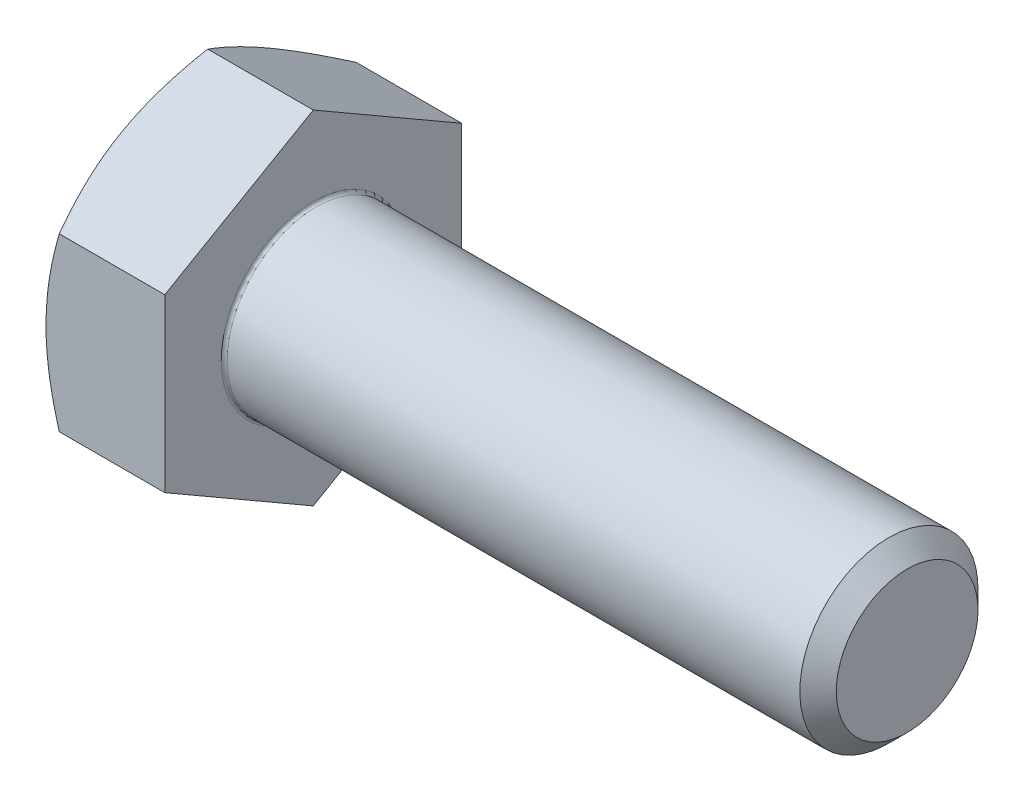
ISO-10303-21;
HEADER;
FILE_DESCRIPTION(('STEP AP214'),'2;1');
FILE_NAME('part.step','',(''),(''),'','','');
FILE_SCHEMA(('AUTOMOTIVE_DESIGN { 1 0 10303 214 1 1 1 1 }'));
ENDSEC;
DATA;
#1=APPLICATION_CONTEXT('core data for automotive mechanical design processes');
#2=APPLICATION_PROTOCOL_DEFINITION('international standard','automotive_design',2000,#1);
#3=PRODUCT_CONTEXT('',#1,'mechanical');
#4=PRODUCT('Part','Part','',(#3));
#5=PRODUCT_RELATED_PRODUCT_CATEGORY('part','',(#4));
#6=PRODUCT_DEFINITION_FORMATION('','',#4);
#7=PRODUCT_DEFINITION_CONTEXT('part definition',#1,'design');
#8=PRODUCT_DEFINITION('design','',#6,#7);
#9=PRODUCT_DEFINITION_SHAPE('','',#8);
#10=(LENGTH_UNIT() NAMED_UNIT(*) SI_UNIT(.MILLI.,.METRE.));
#11=(NAMED_UNIT(*) PLANE_ANGLE_UNIT() SI_UNIT($,.RADIAN.));
#12=(NAMED_UNIT(*) SI_UNIT($,.STERADIAN.) SOLID_ANGLE_UNIT());
#13=UNCERTAINTY_MEASURE_WITH_UNIT(LENGTH_MEASURE(1.E-05),#10,'distance_accuracy_value','');
#14=(GEOMETRIC_REPRESENTATION_CONTEXT(3) GLOBAL_UNCERTAINTY_ASSIGNED_CONTEXT((#13)) GLOBAL_UNIT_ASSIGNED_CONTEXT((#10,
#11,#12)) REPRESENTATION_CONTEXT('',''));
#15=CARTESIAN_POINT('',(0.,0.,0.));
#16=DIRECTION('',(0.,0.,1.));
#17=DIRECTION('',(1.,0.,0.));
#18=AXIS2_PLACEMENT_3D('',#15,#16,#17);
#19=CARTESIAN_POINT('',(-4.,0.,0.));
#20=DIRECTION('',(1.,0.,0.));
#21=DIRECTION('',(0.,1.,0.));
#22=AXIS2_PLACEMENT_3D('',#19,#20,#21);
#23=PLANE('',#22);
#24=CARTESIAN_POINT('',(-4.,0.,0.));
#25=DIRECTION('',(-1.,0.,0.));
#26=DIRECTION('',(0.,1.,0.));
#27=AXIS2_PLACEMENT_3D('',#24,#25,#26);
#28=CIRCLE('',#27,5.);
#29=CARTESIAN_POINT('',(-4.,4.33012701892219,-2.5));
#30=VERTEX_POINT('',#29);
#31=CARTESIAN_POINT('',(-4.,0.,-5.));
#32=VERTEX_POINT('',#31);
#33=EDGE_CURVE('E210',#30,#32,#28,.T.);
#34=ORIENTED_EDGE('',*,*,#33,.T.);
#35=CARTESIAN_POINT('',(-4.,0.,0.));
#36=DIRECTION('',(-1.,0.,0.));
#37=DIRECTION('',(0.,1.,0.));
#38=AXIS2_PLACEMENT_3D('',#35,#36,#37);
#39=CIRCLE('',#38,5.);
#40=CARTESIAN_POINT('',(-4.,-4.33012701892219,-2.5));
#41=VERTEX_POINT('',#40);
#42=EDGE_CURVE('E114',#32,#41,#39,.T.);
#43=ORIENTED_EDGE('',*,*,#42,.T.);
#44=CARTESIAN_POINT('',(-4.,0.,0.));
#45=DIRECTION('',(-1.,0.,0.));
#46=DIRECTION('',(0.,1.,0.));
#47=AXIS2_PLACEMENT_3D('',#44,#45,#46);
#48=CIRCLE('',#47,5.);
#49=CARTESIAN_POINT('',(-4.,-4.33012701892219,2.5));
#50=VERTEX_POINT('',#49);
#51=EDGE_CURVE('E231',#41,#50,#48,.T.);
#52=ORIENTED_EDGE('',*,*,#51,.T.);
#53=CARTESIAN_POINT('',(-4.,0.,0.));
#54=DIRECTION('',(-1.,0.,0.));
#55=DIRECTION('',(0.,1.,0.));
#56=AXIS2_PLACEMENT_3D('',#53,#54,#55);
#57=CIRCLE('',#56,5.);
#58=CARTESIAN_POINT('',(-4.,0.,5.));
#59=VERTEX_POINT('',#58);
#60=EDGE_CURVE('E20',#50,#59,#57,.T.);
#61=ORIENTED_EDGE('',*,*,#60,.T.);
#62=CARTESIAN_POINT('',(-4.,0.,0.));
#63=DIRECTION('',(-1.,0.,0.));
#64=DIRECTION('',(0.,1.,0.));
#65=AXIS2_PLACEMENT_3D('',#62,#63,#64);
#66=CIRCLE('',#65,5.);
#67=CARTESIAN_POINT('',(-4.,4.33012701892219,2.5));
#68=VERTEX_POINT('',#67);
#69=EDGE_CURVE('E153',#59,#68,#66,.T.);
#70=ORIENTED_EDGE('',*,*,#69,.T.);
#71=CARTESIAN_POINT('',(-4.,0.,0.));
#72=DIRECTION('',(-1.,0.,0.));
#73=DIRECTION('',(0.,1.,0.));
#74=AXIS2_PLACEMENT_3D('',#71,#72,#73);
#75=CIRCLE('',#74,5.);
#76=EDGE_CURVE('E186',#68,#30,#75,.T.);
#77=ORIENTED_EDGE('',*,*,#76,.T.);
#78=EDGE_LOOP('',(#34,#43,#52,#61,#70,#77));
#79=FACE_BOUND('',#78,.T.);
#80=ADVANCED_FACE('F16',(#79),#23,.F.);
#81=CARTESIAN_POINT('',(0.,5.77350269189625,0.));
#82=DIRECTION('',(0.,0.866025403784438,0.5));
#83=DIRECTION('',(1.,0.,0.));
#84=AXIS2_PLACEMENT_3D('',#81,#82,#83);
#85=PLANE('',#84);
#86=CARTESIAN_POINT('',(-4.,4.33012701892219,2.5));
#87=CARTESIAN_POINT('',(-4.,3.66025403784439,3.66025403784437));
#88=CARTESIAN_POINT('',(-3.5534180126148,2.88675134594812,5.));
#89=(BOUNDED_CURVE() B_SPLINE_CURVE(2,(#86,#87,#88),.UNSPECIFIED.,.F.,
.F.) B_SPLINE_CURVE_WITH_KNOTS((3,3),(0.337692975540227,0.636174641111843),
.UNSPECIFIED.) CURVE() GEOMETRIC_REPRESENTATION_ITEM() RATIONAL_B_SPLINE_CURVE((1.,
1.04314139574018,1.0100187493574)) REPRESENTATION_ITEM(''));
#90=CARTESIAN_POINT('',(-3.5534180126148,2.88675134594812,5.));
#91=VERTEX_POINT('',#90);
#92=EDGE_CURVE('E201',#68,#91,#89,.T.);
#93=ORIENTED_EDGE('',*,*,#92,.T.);
#94=DIRECTION('',(-1.,0.,0.));
#95=VECTOR('',#94,1.);
#96=CARTESIAN_POINT('',(0.,2.88675134594812,5.));
#97=LINE('',#96,#95);
#98=CARTESIAN_POINT('',(0.,2.88675134594812,5.));
#99=VERTEX_POINT('',#98);
#100=EDGE_CURVE('E27',#99,#91,#97,.T.);
#101=ORIENTED_EDGE('',*,*,#100,.F.);
#102=DIRECTION('',(0.,-0.5,0.866025403784438));
#103=VECTOR('',#102,1.);
#104=CARTESIAN_POINT('',(0.,5.77350269189625,0.));
#105=LINE('',#104,#103);
#106=CARTESIAN_POINT('',(0.,5.77350269189625,0.));
#107=VERTEX_POINT('',#106);
#108=EDGE_CURVE('E167',#107,#99,#105,.T.);
#109=ORIENTED_EDGE('',*,*,#108,.F.);
#110=DIRECTION('',(-1.,0.,0.));
#111=VECTOR('',#110,1.);
#112=CARTESIAN_POINT('',(0.,5.77350269189625,0.));
#113=LINE('',#112,#111);
#114=CARTESIAN_POINT('',(-3.5534180126148,5.77350269189625,0.));
#115=VERTEX_POINT('',#114);
#116=EDGE_CURVE('E11',#107,#115,#113,.T.);
#117=ORIENTED_EDGE('',*,*,#116,.T.);
#118=CARTESIAN_POINT('',(-3.5534180126148,5.77350269189625,0.));
#119=CARTESIAN_POINT('',(-4.,4.99999999999999,1.33974596215563));
#120=CARTESIAN_POINT('',(-4.,4.33012701892219,2.5));
#121=(BOUNDED_CURVE() B_SPLINE_CURVE(2,(#118,#119,#120),.UNSPECIFIED.,.F.,
.F.) B_SPLINE_CURVE_WITH_KNOTS((3,3),(0.0392113099686116,0.337692975540227),
.UNSPECIFIED.) CURVE() GEOMETRIC_REPRESENTATION_ITEM() RATIONAL_B_SPLINE_CURVE((1.0100187493574,
1.04314139574016,1.)) REPRESENTATION_ITEM(''));
#122=EDGE_CURVE('E170',#115,#68,#121,.T.);
#123=ORIENTED_EDGE('',*,*,#122,.T.);
#124=EDGE_LOOP('',(#93,#101,#109,#117,#123));
#125=FACE_BOUND('',#124,.T.);
#126=ADVANCED_FACE('F428',(#125),#85,.T.);
#127=CARTESIAN_POINT('',(0.,2.88675134594813,-5.));
#128=DIRECTION('',(0.,0.866025403784439,-0.5));
#129=DIRECTION('',(-1.,0.,0.));
#130=AXIS2_PLACEMENT_3D('',#127,#128,#129);
#131=PLANE('',#130);
#132=CARTESIAN_POINT('',(-4.,4.33012701892219,-2.5));
#133=CARTESIAN_POINT('',(-4.,4.99999999999999,-1.33974596215562));
#134=CARTESIAN_POINT('',(-3.5534180126148,5.77350269189625,0.));
#135=(BOUNDED_CURVE() B_SPLINE_CURVE(2,(#132,#133,#134),.UNSPECIFIED.,.F.,
.F.) B_SPLINE_CURVE_WITH_KNOTS((3,3),(0.337692975540226,0.636174641111842),
.UNSPECIFIED.) CURVE() GEOMETRIC_REPRESENTATION_ITEM() RATIONAL_B_SPLINE_CURVE((1.,
1.04314139574017,1.0100187493574)) REPRESENTATION_ITEM(''));
#136=EDGE_CURVE('E177',#30,#115,#135,.T.);
#137=ORIENTED_EDGE('',*,*,#136,.T.);
#138=ORIENTED_EDGE('',*,*,#116,.F.);
#139=DIRECTION('',(0.,0.5,0.866025403784439));
#140=VECTOR('',#139,1.);
#141=CARTESIAN_POINT('',(0.,2.88675134594813,-5.));
#142=LINE('',#141,#140);
#143=CARTESIAN_POINT('',(0.,2.88675134594813,-5.));
#144=VERTEX_POINT('',#143);
#145=EDGE_CURVE('E154',#144,#107,#142,.T.);
#146=ORIENTED_EDGE('',*,*,#145,.F.);
#147=DIRECTION('',(-1.,0.,0.));
#148=VECTOR('',#147,1.);
#149=CARTESIAN_POINT('',(0.,2.88675134594813,-5.));
#150=LINE('',#149,#148);
#151=CARTESIAN_POINT('',(-3.5534180126148,2.88675134594813,-5.));
#152=VERTEX_POINT('',#151);
#153=EDGE_CURVE('E41',#144,#152,#150,.T.);
#154=ORIENTED_EDGE('',*,*,#153,.T.);
#155=CARTESIAN_POINT('',(-3.5534180126148,2.88675134594813,-5.));
#156=CARTESIAN_POINT('',(-4.,3.66025403784439,-3.66025403784437));
#157=CARTESIAN_POINT('',(-4.,4.33012701892219,-2.5));
#158=(BOUNDED_CURVE() B_SPLINE_CURVE(2,(#155,#156,#157),.UNSPECIFIED.,.F.,
.F.) B_SPLINE_CURVE_WITH_KNOTS((3,3),(0.0392113099686102,0.337692975540226),
.UNSPECIFIED.) CURVE() GEOMETRIC_REPRESENTATION_ITEM() RATIONAL_B_SPLINE_CURVE((1.0100187493574,
1.04314139574018,1.)) REPRESENTATION_ITEM(''));
#159=EDGE_CURVE('E202',#152,#30,#158,.T.);
#160=ORIENTED_EDGE('',*,*,#159,.T.);
#161=EDGE_LOOP('',(#137,#138,#146,#154,#160));
#162=FACE_BOUND('',#161,.T.);
#163=ADVANCED_FACE('F333',(#162),#131,.T.);
#164=CARTESIAN_POINT('',(0.,2.88675134594812,5.));
#165=DIRECTION('',(0.,0.,1.));
#166=DIRECTION('',(0.,-1.,0.));
#167=AXIS2_PLACEMENT_3D('',#164,#165,#166);
#168=PLANE('',#167);
#169=CARTESIAN_POINT('',(-4.,0.,5.));
#170=CARTESIAN_POINT('',(-4.,-1.3397459621556,5.));
#171=CARTESIAN_POINT('',(-3.5534180126148,-2.88675134594813,4.99999999999999));
#172=(BOUNDED_CURVE() B_SPLINE_CURVE(2,(#169,#170,#171),.UNSPECIFIED.,.F.,
.F.) B_SPLINE_CURVE_WITH_KNOTS((3,3),(0.337692975540227,0.636174641111843),
.UNSPECIFIED.) CURVE() GEOMETRIC_REPRESENTATION_ITEM() RATIONAL_B_SPLINE_CURVE((1.,
1.04314139574018,1.0100187493574)) REPRESENTATION_ITEM(''));
#173=CARTESIAN_POINT('',(-3.5534180126148,-2.88675134594813,5.));
#174=VERTEX_POINT('',#173);
#175=EDGE_CURVE('E143',#59,#174,#172,.T.);
#176=ORIENTED_EDGE('',*,*,#175,.T.);
#177=DIRECTION('',(-1.,0.,0.));
#178=VECTOR('',#177,1.);
#179=CARTESIAN_POINT('',(0.,-2.88675134594813,5.));
#180=LINE('',#179,#178);
#181=CARTESIAN_POINT('',(0.,-2.88675134594813,5.));
#182=VERTEX_POINT('',#181);
#183=EDGE_CURVE('E232',#182,#174,#180,.T.);
#184=ORIENTED_EDGE('',*,*,#183,.F.);
#185=DIRECTION('',(0.,-1.,0.));
#186=VECTOR('',#185,1.);
#187=CARTESIAN_POINT('',(0.,2.88675134594812,5.));
#188=LINE('',#187,#186);
#189=EDGE_CURVE('E163',#99,#182,#188,.T.);
#190=ORIENTED_EDGE('',*,*,#189,.F.);
#191=ORIENTED_EDGE('',*,*,#100,.T.);
#192=CARTESIAN_POINT('',(-3.5534180126148,2.88675134594812,5.));
#193=CARTESIAN_POINT('',(-4.,1.3397459621556,5.));
#194=CARTESIAN_POINT('',(-4.,0.,5.));
#195=(BOUNDED_CURVE() B_SPLINE_CURVE(2,(#192,#193,#194),.UNSPECIFIED.,.F.,
.F.) B_SPLINE_CURVE_WITH_KNOTS((3,3),(0.0392113099686117,0.337692975540227),
.UNSPECIFIED.) CURVE() GEOMETRIC_REPRESENTATION_ITEM() RATIONAL_B_SPLINE_CURVE((1.0100187493574,
1.04314139574017,1.)) REPRESENTATION_ITEM(''));
#196=EDGE_CURVE('E192',#91,#59,#195,.T.);
#197=ORIENTED_EDGE('',*,*,#196,.T.);
#198=EDGE_LOOP('',(#176,#184,#190,#191,#197));
#199=FACE_BOUND('',#198,.T.);
#200=ADVANCED_FACE('F401',(#199),#168,.T.);
#201=CARTESIAN_POINT('',(0.,-2.88675134594812,-5.));
#202=DIRECTION('',(0.,0.,-1.));
#203=DIRECTION('',(-1.,0.,0.));
#204=AXIS2_PLACEMENT_3D('',#201,#202,#203);
#205=PLANE('',#204);
#206=CARTESIAN_POINT('',(-3.5534180126148,-2.88675134594812,-5.));
#207=CARTESIAN_POINT('',(-4.,-1.3397459621556,-5.));
#208=CARTESIAN_POINT('',(-4.,0.,-5.));
#209=(BOUNDED_CURVE() B_SPLINE_CURVE(2,(#206,#207,#208),.UNSPECIFIED.,.F.,
.F.) B_SPLINE_CURVE_WITH_KNOTS((3,3),(0.0392113099686106,0.337692975540227),
.UNSPECIFIED.) CURVE() GEOMETRIC_REPRESENTATION_ITEM() RATIONAL_B_SPLINE_CURVE((1.0100187493574,
1.04314139574019,1.)) REPRESENTATION_ITEM(''));
#210=CARTESIAN_POINT('',(-3.5534180126148,-2.88675134594812,-5.));
#211=VERTEX_POINT('',#210);
#212=EDGE_CURVE('E263',#211,#32,#209,.T.);
#213=ORIENTED_EDGE('',*,*,#212,.T.);
#214=CARTESIAN_POINT('',(-4.,0.,-5.));
#215=CARTESIAN_POINT('',(-4.,1.3397459621556,-5.));
#216=CARTESIAN_POINT('',(-3.5534180126148,2.88675134594813,-5.));
#217=(BOUNDED_CURVE() B_SPLINE_CURVE(2,(#214,#215,#216),.UNSPECIFIED.,.F.,
.F.) B_SPLINE_CURVE_WITH_KNOTS((3,3),(0.337692975540227,0.636174641111842),
.UNSPECIFIED.) CURVE() GEOMETRIC_REPRESENTATION_ITEM() RATIONAL_B_SPLINE_CURVE((1.,
1.04314139574017,1.0100187493574)) REPRESENTATION_ITEM(''));
#218=EDGE_CURVE('E257',#32,#152,#217,.T.);
#219=ORIENTED_EDGE('',*,*,#218,.T.);
#220=ORIENTED_EDGE('',*,*,#153,.F.);
#221=DIRECTION('',(0.,1.,0.));
#222=VECTOR('',#221,1.);
#223=CARTESIAN_POINT('',(0.,-2.88675134594812,-5.));
#224=LINE('',#223,#222);
#225=CARTESIAN_POINT('',(0.,-2.88675134594812,-5.));
#226=VERTEX_POINT('',#225);
#227=EDGE_CURVE('E162',#226,#144,#224,.T.);
#228=ORIENTED_EDGE('',*,*,#227,.F.);
#229=DIRECTION('',(-1.,0.,0.));
#230=VECTOR('',#229,1.);
#231=CARTESIAN_POINT('',(0.,-2.88675134594812,-5.));
#232=LINE('',#231,#230);
#233=EDGE_CURVE('E238',#226,#211,#232,.T.);
#234=ORIENTED_EDGE('',*,*,#233,.T.);
#235=EDGE_LOOP('',(#213,#219,#220,#228,#234));
#236=FACE_BOUND('',#235,.T.);
#237=ADVANCED_FACE('F302',(#236),#205,.T.);
#238=CARTESIAN_POINT('',(0.,-5.77350269189625,0.));
#239=DIRECTION('',(0.,-0.866025403784439,-0.5));
#240=DIRECTION('',(0.,0.5,-0.866025403784439));
#241=AXIS2_PLACEMENT_3D('',#238,#239,#240);
#242=PLANE('',#241);
#243=CARTESIAN_POINT('',(-3.5534180126148,-5.77350269189625,0.));
#244=CARTESIAN_POINT('',(-4.,-4.99999999999999,-1.33974596215562));
#245=CARTESIAN_POINT('',(-4.,-4.33012701892219,-2.5));
#246=(BOUNDED_CURVE() B_SPLINE_CURVE(2,(#243,#244,#245),.UNSPECIFIED.,.F.,
.F.) B_SPLINE_CURVE_WITH_KNOTS((3,3),(0.0392113099686105,0.337692975540227),
.UNSPECIFIED.) CURVE() GEOMETRIC_REPRESENTATION_ITEM() RATIONAL_B_SPLINE_CURVE((1.01001874935741,
1.04314139574019,1.)) REPRESENTATION_ITEM(''));
#247=CARTESIAN_POINT('',(-3.5534180126148,-5.77350269189625,0.));
#248=VERTEX_POINT('',#247);
#249=EDGE_CURVE('E222',#248,#41,#246,.T.);
#250=ORIENTED_EDGE('',*,*,#249,.T.);
#251=CARTESIAN_POINT('',(-4.,-4.33012701892219,-2.5));
#252=CARTESIAN_POINT('',(-4.,-3.66025403784439,-3.66025403784438));
#253=CARTESIAN_POINT('',(-3.5534180126148,-2.88675134594812,-5.));
#254=(BOUNDED_CURVE() B_SPLINE_CURVE(2,(#251,#252,#253),.UNSPECIFIED.,.F.,
.F.) B_SPLINE_CURVE_WITH_KNOTS((3,3),(0.337692975540227,0.636174641111843),
.UNSPECIFIED.) CURVE() GEOMETRIC_REPRESENTATION_ITEM() RATIONAL_B_SPLINE_CURVE((1.,
1.04314139574018,1.0100187493574)) REPRESENTATION_ITEM(''));
#255=EDGE_CURVE('E230',#41,#211,#254,.T.);
#256=ORIENTED_EDGE('',*,*,#255,.T.);
#257=ORIENTED_EDGE('',*,*,#233,.F.);
#258=DIRECTION('',(0.,0.5,-0.866025403784439));
#259=VECTOR('',#258,1.);
#260=CARTESIAN_POINT('',(0.,-5.77350269189625,0.));
#261=LINE('',#260,#259);
#262=CARTESIAN_POINT('',(0.,-5.77350269189625,0.));
#263=VERTEX_POINT('',#262);
#264=EDGE_CURVE('E211',#263,#226,#261,.T.);
#265=ORIENTED_EDGE('',*,*,#264,.F.);
#266=DIRECTION('',(-1.,0.,0.));
#267=VECTOR('',#266,1.);
#268=CARTESIAN_POINT('',(0.,-5.77350269189625,0.));
#269=LINE('',#268,#267);
#270=EDGE_CURVE('E104',#263,#248,#269,.T.);
#271=ORIENTED_EDGE('',*,*,#270,.T.);
#272=EDGE_LOOP('',(#250,#256,#257,#265,#271));
#273=FACE_BOUND('',#272,.T.);
#274=ADVANCED_FACE('F307',(#273),#242,.T.);
#275=CARTESIAN_POINT('',(0.,-2.88675134594813,5.));
#276=DIRECTION('',(0.,-0.866025403784439,0.5));
#277=DIRECTION('',(-1.,0.,0.));
#278=AXIS2_PLACEMENT_3D('',#275,#276,#277);
#279=PLANE('',#278);
#280=CARTESIAN_POINT('',(-3.5534180126148,-2.88675134594813,4.99999999999999));
#281=CARTESIAN_POINT('',(-4.,-3.66025403784439,3.66025403784437));
#282=CARTESIAN_POINT('',(-4.,-4.33012701892219,2.5));
#283=(BOUNDED_CURVE() B_SPLINE_CURVE(2,(#280,#281,#282),.UNSPECIFIED.,.F.,
.F.) B_SPLINE_CURVE_WITH_KNOTS((3,3),(0.0392113099686108,0.337692975540227),
.UNSPECIFIED.) CURVE() GEOMETRIC_REPRESENTATION_ITEM() RATIONAL_B_SPLINE_CURVE((1.01001874935741,
1.04314139574019,1.)) REPRESENTATION_ITEM(''));
#284=EDGE_CURVE('E147',#174,#50,#283,.T.);
#285=ORIENTED_EDGE('',*,*,#284,.T.);
#286=CARTESIAN_POINT('',(-4.,-4.33012701892219,2.5));
#287=CARTESIAN_POINT('',(-4.,-4.99999999999999,1.33974596215562));
#288=CARTESIAN_POINT('',(-3.5534180126148,-5.77350269189625,0.));
#289=(BOUNDED_CURVE() B_SPLINE_CURVE(2,(#286,#287,#288),.UNSPECIFIED.,.F.,
.F.) B_SPLINE_CURVE_WITH_KNOTS((3,3),(0.337692975540227,0.636174641111843),
.UNSPECIFIED.) CURVE() GEOMETRIC_REPRESENTATION_ITEM() RATIONAL_B_SPLINE_CURVE((1.,
1.04314139574019,1.01001874935741)) REPRESENTATION_ITEM(''));
#290=EDGE_CURVE('E273',#50,#248,#289,.T.);
#291=ORIENTED_EDGE('',*,*,#290,.T.);
#292=ORIENTED_EDGE('',*,*,#270,.F.);
#293=DIRECTION('',(0.,-0.5,-0.866025403784439));
#294=VECTOR('',#293,1.);
#295=CARTESIAN_POINT('',(0.,-2.88675134594813,5.));
#296=LINE('',#295,#294);
#297=EDGE_CURVE('E166',#182,#263,#296,.T.);
#298=ORIENTED_EDGE('',*,*,#297,.F.);
#299=ORIENTED_EDGE('',*,*,#183,.T.);
#300=EDGE_LOOP('',(#285,#291,#292,#298,#299));
#301=FACE_BOUND('',#300,.T.);
#302=ADVANCED_FACE('F469',(#301),#279,.T.);
#303=CARTESIAN_POINT('',(-3.71132486540519,0.,0.));
#304=DIRECTION('',(1.,0.,0.));
#305=DIRECTION('',(0.,1.,0.));
#306=AXIS2_PLACEMENT_3D('',#303,#304,#305);
#307=CONICAL_SURFACE('',#306,5.5,1.0471975512);
#308=ORIENTED_EDGE('',*,*,#218,.F.);
#309=ORIENTED_EDGE('',*,*,#33,.F.);
#310=ORIENTED_EDGE('',*,*,#159,.F.);
#311=EDGE_LOOP('',(#308,#309,#310));
#312=FACE_BOUND('',#311,.T.);
#313=ADVANCED_FACE('F332',(#312),#307,.T.);
#314=CARTESIAN_POINT('',(-3.71132486540519,0.,0.));
#315=DIRECTION('',(1.,0.,0.));
#316=DIRECTION('',(0.,1.,0.));
#317=AXIS2_PLACEMENT_3D('',#314,#315,#316);
#318=CONICAL_SURFACE('',#317,5.5,1.0471975512);
#319=ORIENTED_EDGE('',*,*,#255,.F.);
#320=ORIENTED_EDGE('',*,*,#42,.F.);
#321=ORIENTED_EDGE('',*,*,#212,.F.);
#322=EDGE_LOOP('',(#319,#320,#321));
#323=FACE_BOUND('',#322,.T.);
#324=ADVANCED_FACE('F305',(#323),#318,.T.);
#325=CARTESIAN_POINT('',(-3.71132486540519,0.,0.));
#326=DIRECTION('',(1.,0.,0.));
#327=DIRECTION('',(0.,1.,0.));
#328=AXIS2_PLACEMENT_3D('',#325,#326,#327);
#329=CONICAL_SURFACE('',#328,5.5,1.0471975512);
#330=ORIENTED_EDGE('',*,*,#290,.F.);
#331=ORIENTED_EDGE('',*,*,#51,.F.);
#332=ORIENTED_EDGE('',*,*,#249,.F.);
#333=EDGE_LOOP('',(#330,#331,#332));
#334=FACE_BOUND('',#333,.T.);
#335=ADVANCED_FACE('F506',(#334),#329,.T.);
#336=CARTESIAN_POINT('',(-3.71132486540519,0.,0.));
#337=DIRECTION('',(1.,0.,0.));
#338=DIRECTION('',(0.,1.,0.));
#339=AXIS2_PLACEMENT_3D('',#336,#337,#338);
#340=CONICAL_SURFACE('',#339,5.5,1.0471975512);
#341=ORIENTED_EDGE('',*,*,#284,.F.);
#342=ORIENTED_EDGE('',*,*,#175,.F.);
#343=ORIENTED_EDGE('',*,*,#60,.F.);
#344=EDGE_LOOP('',(#341,#342,#343));
#345=FACE_BOUND('',#344,.T.);
#346=ADVANCED_FACE('F18',(#345),#340,.T.);
#347=CARTESIAN_POINT('',(-3.71132486540519,0.,0.));
#348=DIRECTION('',(1.,0.,0.));
#349=DIRECTION('',(0.,1.,0.));
#350=AXIS2_PLACEMENT_3D('',#347,#348,#349);
#351=CONICAL_SURFACE('',#350,5.5,1.0471975512);
#352=ORIENTED_EDGE('',*,*,#196,.F.);
#353=ORIENTED_EDGE('',*,*,#92,.F.);
#354=ORIENTED_EDGE('',*,*,#69,.F.);
#355=EDGE_LOOP('',(#352,#353,#354));
#356=FACE_BOUND('',#355,.T.);
#357=ADVANCED_FACE('F418',(#356),#351,.T.);
#358=CARTESIAN_POINT('',(-3.71132486540519,0.,0.));
#359=DIRECTION('',(1.,0.,0.));
#360=DIRECTION('',(0.,1.,0.));
#361=AXIS2_PLACEMENT_3D('',#358,#359,#360);
#362=CONICAL_SURFACE('',#361,5.5,1.0471975512);
#363=ORIENTED_EDGE('',*,*,#122,.F.);
#364=ORIENTED_EDGE('',*,*,#136,.F.);
#365=ORIENTED_EDGE('',*,*,#76,.F.);
#366=EDGE_LOOP('',(#363,#364,#365));
#367=FACE_BOUND('',#366,.T.);
#368=ADVANCED_FACE('F412',(#367),#362,.T.);
#369=CARTESIAN_POINT('',(20.,1.5,0.));
#370=DIRECTION('',(1.,0.,0.));
#371=DIRECTION('',(0.,1.,0.));
#372=AXIS2_PLACEMENT_3D('',#369,#370,#371);
#373=PLANE('',#372);
#374=CARTESIAN_POINT('',(20.,0.,0.));
#375=DIRECTION('',(-1.,0.,0.));
#376=DIRECTION('',(0.,-1.,0.));
#377=AXIS2_PLACEMENT_3D('',#374,#375,#376);
#378=CIRCLE('',#377,2.38655);
#379=CARTESIAN_POINT('',(20.,2.38655,0.));
#380=VERTEX_POINT('',#379);
#381=EDGE_CURVE('E161',#380,#380,#378,.T.);
#382=ORIENTED_EDGE('',*,*,#381,.F.);
#383=EDGE_LOOP('',(#382));
#384=FACE_BOUND('',#383,.T.);
#385=ADVANCED_FACE('F417',(#384),#373,.T.);
#386=CARTESIAN_POINT('',(19.693225,0.,0.));
#387=DIRECTION('',(-1.,0.,0.));
#388=DIRECTION('',(0.,-1.,0.));
#389=AXIS2_PLACEMENT_3D('',#386,#387,#388);
#390=CONICAL_SURFACE('',#389,2.693275,0.785316663807675);
#391=ORIENTED_EDGE('',*,*,#381,.T.);
#392=EDGE_LOOP('',(#391));
#393=FACE_BOUND('',#392,.T.);
#394=CARTESIAN_POINT('',(19.38645,0.,0.));
#395=DIRECTION('',(1.,0.,0.));
#396=DIRECTION('',(0.,-1.,0.));
#397=AXIS2_PLACEMENT_3D('',#394,#395,#396);
#398=CIRCLE('',#397,3.);
#399=CARTESIAN_POINT('',(19.38645,3.,0.));
#400=VERTEX_POINT('',#399);
#401=EDGE_CURVE('E139',#400,#400,#398,.T.);
#402=ORIENTED_EDGE('',*,*,#401,.T.);
#403=EDGE_LOOP('',(#402));
#404=FACE_BOUND('',#403,.T.);
#405=ADVANCED_FACE('F453',(#393,#404),#390,.T.);
#406=CARTESIAN_POINT('',(0.,0.,0.));
#407=DIRECTION('',(1.,0.,0.));
#408=DIRECTION('',(0.,1.,0.));
#409=AXIS2_PLACEMENT_3D('',#406,#407,#408);
#410=PLANE('',#409);
#411=CARTESIAN_POINT('',(0.,0.,0.));
#412=DIRECTION('',(1.,0.,0.));
#413=DIRECTION('',(0.,-1.,0.));
#414=AXIS2_PLACEMENT_3D('',#411,#412,#413);
#415=CIRCLE('',#414,3.1);
#416=CARTESIAN_POINT('',(0.,3.1,0.));
#417=VERTEX_POINT('',#416);
#418=EDGE_CURVE('E129',#417,#417,#415,.T.);
#419=ORIENTED_EDGE('',*,*,#418,.F.);
#420=EDGE_LOOP('',(#419));
#421=FACE_BOUND('',#420,.T.);
#422=ORIENTED_EDGE('',*,*,#108,.T.);
#423=ORIENTED_EDGE('',*,*,#189,.T.);
#424=ORIENTED_EDGE('',*,*,#297,.T.);
#425=ORIENTED_EDGE('',*,*,#264,.T.);
#426=ORIENTED_EDGE('',*,*,#227,.T.);
#427=ORIENTED_EDGE('',*,*,#145,.T.);
#428=EDGE_LOOP('',(#422,#423,#424,#425,#426,#427));
#429=FACE_BOUND('',#428,.T.);
#430=ADVANCED_FACE('F334',(#421,#429),#410,.T.);
#431=CARTESIAN_POINT('',(10.,0.,0.));
#432=DIRECTION('',(1.,0.,0.));
#433=DIRECTION('',(0.,1.,0.));
#434=AXIS2_PLACEMENT_3D('',#431,#432,#433);
#435=CYLINDRICAL_SURFACE('',#434,3.);
#436=CARTESIAN_POINT('',(0.1,0.,0.));
#437=DIRECTION('',(-1.,0.,0.));
#438=DIRECTION('',(0.,-1.,0.));
#439=AXIS2_PLACEMENT_3D('',#436,#437,#438);
#440=CIRCLE('',#439,3.);
#441=CARTESIAN_POINT('',(0.1,3.,0.));
#442=VERTEX_POINT('',#441);
#443=EDGE_CURVE('E133',#442,#442,#440,.T.);
#444=ORIENTED_EDGE('',*,*,#443,.F.);
#445=EDGE_LOOP('',(#444));
#446=FACE_BOUND('',#445,.T.);
#447=ORIENTED_EDGE('',*,*,#401,.F.);
#448=EDGE_LOOP('',(#447));
#449=FACE_BOUND('',#448,.T.);
#450=ADVANCED_FACE('F436',(#446,#449),#435,.T.);
#451=CARTESIAN_POINT('',(0.1,0.,0.));
#452=DIRECTION('',(1.,0.,0.));
#453=DIRECTION('',(0.,0.,-1.));
#454=AXIS2_PLACEMENT_3D('',#451,#452,#453);
#455=TOROIDAL_SURFACE('',#454,3.1,0.1);
#456=ORIENTED_EDGE('',*,*,#443,.T.);
#457=EDGE_LOOP('',(#456));
#458=FACE_BOUND('',#457,.T.);
#459=ORIENTED_EDGE('',*,*,#418,.T.);
#460=EDGE_LOOP('',(#459));
#461=FACE_BOUND('',#460,.T.);
#462=ADVANCED_FACE('F130',(#458,#461),#455,.F.);
#463=CLOSED_SHELL('',(#80,#126,#163,#200,#237,#274,#302,#313,#324,#335,#346,#357,#368,#385,#405,
#430,#450,#462));
#464=MANIFOLD_SOLID_BREP('B1',#463);
#465=ADVANCED_BREP_SHAPE_REPRESENTATION('',(#18,#464),#14);
#466=SHAPE_DEFINITION_REPRESENTATION(#9,#465);
ENDSEC;
END-ISO-10303-21;
